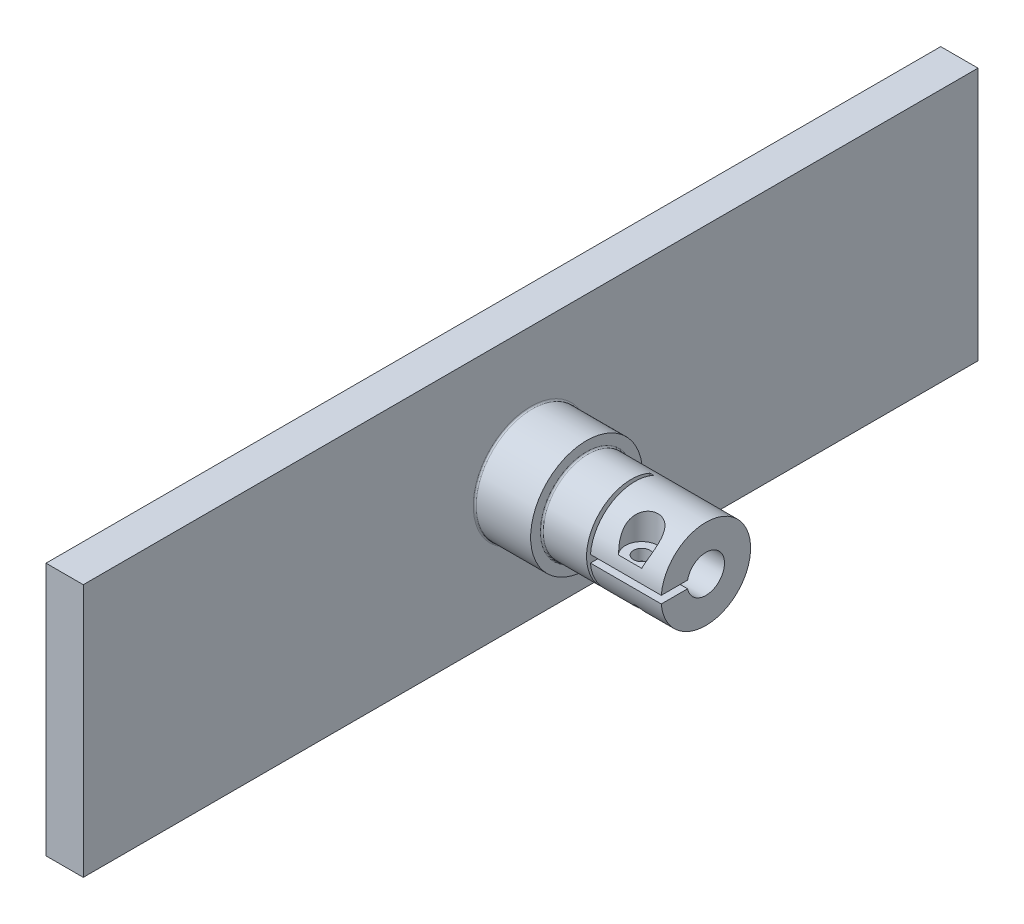
ISO-10303-21;
HEADER;
FILE_DESCRIPTION(('STEP AP214'),'2;1');
FILE_NAME('part.step','',(''),(''),'','','');
FILE_SCHEMA(('AUTOMOTIVE_DESIGN { 1 0 10303 214 1 1 1 1 }'));
ENDSEC;
DATA;
#1=APPLICATION_CONTEXT('core data for automotive mechanical design processes');
#2=APPLICATION_PROTOCOL_DEFINITION('international standard','automotive_design',2000,#1);
#3=PRODUCT_CONTEXT('',#1,'mechanical');
#4=PRODUCT('Part','Part','',(#3));
#5=PRODUCT_RELATED_PRODUCT_CATEGORY('part','',(#4));
#6=PRODUCT_DEFINITION_FORMATION('','',#4);
#7=PRODUCT_DEFINITION_CONTEXT('part definition',#1,'design');
#8=PRODUCT_DEFINITION('design','',#6,#7);
#9=PRODUCT_DEFINITION_SHAPE('','',#8);
#10=(LENGTH_UNIT() NAMED_UNIT(*) SI_UNIT(.MILLI.,.METRE.));
#11=(NAMED_UNIT(*) PLANE_ANGLE_UNIT() SI_UNIT($,.RADIAN.));
#12=(NAMED_UNIT(*) SI_UNIT($,.STERADIAN.) SOLID_ANGLE_UNIT());
#13=UNCERTAINTY_MEASURE_WITH_UNIT(LENGTH_MEASURE(1.E-05),#10,'distance_accuracy_value','');
#14=(GEOMETRIC_REPRESENTATION_CONTEXT(3) GLOBAL_UNCERTAINTY_ASSIGNED_CONTEXT((#13)) GLOBAL_UNIT_ASSIGNED_CONTEXT((#10,
#11,#12)) REPRESENTATION_CONTEXT('',''));
#15=CARTESIAN_POINT('',(0.,0.,0.));
#16=DIRECTION('',(0.,0.,1.));
#17=DIRECTION('',(1.,0.,0.));
#18=AXIS2_PLACEMENT_3D('',#15,#16,#17);
#19=CARTESIAN_POINT('',(19.,17.5,0.));
#20=DIRECTION('',(0.,1.,0.));
#21=DIRECTION('',(0.,0.,1.));
#22=AXIS2_PLACEMENT_3D('',#19,#20,#21);
#23=PLANE('',#22);
#24=DIRECTION('',(0.,0.,1.));
#25=VECTOR('',#24,1.);
#26=CARTESIAN_POINT('',(28.5,17.5,0.));
#27=LINE('',#26,#25);
#28=CARTESIAN_POINT('',(28.5,17.5,62.4494897427832));
#29=VERTEX_POINT('',#28);
#30=CARTESIAN_POINT('',(28.5,17.5,65.9791303715507));
#31=VERTEX_POINT('',#30);
#32=EDGE_CURVE('E218',#29,#31,#27,.T.);
#33=ORIENTED_EDGE('',*,*,#32,.T.);
#34=DIRECTION('',(1.,0.,0.));
#35=VECTOR('',#34,1.);
#36=CARTESIAN_POINT('',(19.,17.5,65.9791303715507));
#37=LINE('',#36,#35);
#38=CARTESIAN_POINT('',(19.,17.5,65.9791303715507));
#39=VERTEX_POINT('',#38);
#40=EDGE_CURVE('E231',#39,#31,#37,.T.);
#41=ORIENTED_EDGE('',*,*,#40,.F.);
#42=DIRECTION('',(0.,0.,1.));
#43=VECTOR('',#42,1.);
#44=CARTESIAN_POINT('',(19.,17.5,0.));
#45=LINE('',#44,#43);
#46=CARTESIAN_POINT('',(19.,17.5,62.4494897427832));
#47=VERTEX_POINT('',#46);
#48=EDGE_CURVE('E238',#47,#39,#45,.T.);
#49=ORIENTED_EDGE('',*,*,#48,.F.);
#50=DIRECTION('',(1.,0.,0.));
#51=VECTOR('',#50,1.);
#52=CARTESIAN_POINT('',(19.,17.5,62.4494897427832));
#53=LINE('',#52,#51);
#54=EDGE_CURVE('E234',#47,#29,#53,.T.);
#55=ORIENTED_EDGE('',*,*,#54,.T.);
#56=EDGE_LOOP('',(#33,#41,#49,#55));
#57=FACE_BOUND('',#56,.T.);
#58=CARTESIAN_POINT('',(24.,17.5,64.1));
#59=DIRECTION('',(0.,1.,0.));
#60=DIRECTION('',(0.,0.,1.));
#61=AXIS2_PLACEMENT_3D('',#58,#59,#60);
#62=CIRCLE('',#61,1.1);
#63=CARTESIAN_POINT('',(24.,17.5,65.2));
#64=VERTEX_POINT('',#63);
#65=EDGE_CURVE('E306',#64,#64,#62,.F.);
#66=ORIENTED_EDGE('',*,*,#65,.F.);
#67=EDGE_LOOP('',(#66));
#68=FACE_BOUND('',#67,.T.);
#69=ADVANCED_FACE('F39',(#57,#68),#23,.F.);
#70=CARTESIAN_POINT('',(28.5,17.,60.));
#71=DIRECTION('',(-1.,0.,0.));
#72=DIRECTION('',(0.,0.,1.));
#73=AXIS2_PLACEMENT_3D('',#70,#71,#72);
#74=CYLINDRICAL_SURFACE('',#73,6.);
#75=CARTESIAN_POINT('',(12.7,17.,60.));
#76=DIRECTION('',(1.,0.,0.));
#77=DIRECTION('',(0.,0.,-1.));
#78=AXIS2_PLACEMENT_3D('',#75,#76,#77);
#79=CIRCLE('',#78,6.);
#80=CARTESIAN_POINT('',(12.7,17.,54.));
#81=VERTEX_POINT('',#80);
#82=EDGE_CURVE('E47',#81,#81,#79,.T.);
#83=ORIENTED_EDGE('',*,*,#82,.T.);
#84=EDGE_LOOP('',(#83));
#85=FACE_BOUND('',#84,.T.);
#86=CARTESIAN_POINT('',(24.,13.5373420613638,64.9));
#87=CARTESIAN_POINT('',(24.0326910598529,13.5373358261282,64.8999960831288));
#88=CARTESIAN_POINT('',(24.0654413604297,13.5344596757837,64.8979670005085));
#89=CARTESIAN_POINT('',(24.1295824931057,13.5233728538796,64.8901028186996));
#90=CARTESIAN_POINT('',(24.1609686036178,13.5151450196477,64.8842554742345));
#91=CARTESIAN_POINT('',(24.2210279802254,13.4945231042613,64.8694751126386));
#92=CARTESIAN_POINT('',(24.2497314549821,13.4821851441088,64.8605836182522));
#93=CARTESIAN_POINT('',(24.3045790675066,13.4543676173585,64.840329386584));
#94=CARTESIAN_POINT('',(24.3307227886647,13.438887540625,64.828966247999));
#95=CARTESIAN_POINT('',(24.3967939777907,13.3947568004842,64.7961841262141));
#96=CARTESIAN_POINT('',(24.4345369496735,13.3641195411807,64.7730528189364));
#97=CARTESIAN_POINT('',(24.503812646507,13.2992031672132,64.7229024486574));
#98=CARTESIAN_POINT('',(24.5353252437258,13.264912782615,64.6958712579704));
#99=CARTESIAN_POINT('',(24.6075638571252,13.1760248874167,64.6240592509601));
#100=CARTESIAN_POINT('',(24.6446679248419,13.1200696438822,64.5773106045231));
#101=CARTESIAN_POINT('',(24.7072096740054,13.0064219896725,64.478508854471));
#102=CARTESIAN_POINT('',(24.7326354419118,12.9487278687276,64.4264503999385));
#103=CARTESIAN_POINT('',(24.7723779951645,12.8318717444481,64.3166303674465));
#104=CARTESIAN_POINT('',(24.7863862384601,12.7727108903284,64.2587550946613));
#105=CARTESIAN_POINT('',(24.8012548368551,12.6560891268234,64.1397287512114));
#106=CARTESIAN_POINT('',(24.8021318254665,12.5986261588591,64.0785819232693));
#107=CARTESIAN_POINT('',(24.7905510698033,12.4989655565948,63.9679971067146));
#108=CARTESIAN_POINT('',(24.7808985232147,12.4561267836209,63.9188445001562));
#109=CARTESIAN_POINT('',(24.7514904426036,12.3735135399139,63.8209554622128));
#110=CARTESIAN_POINT('',(24.7317472872578,12.3337353831931,63.7722185951223));
#111=CARTESIAN_POINT('',(24.6864275894139,12.2661766058078,63.6869028600174));
#112=CARTESIAN_POINT('',(24.6628729684121,12.2376070462082,63.6498777330092));
#113=CARTESIAN_POINT('',(24.6085110487716,12.183923366862,63.5787404191828));
#114=CARTESIAN_POINT('',(24.5777119553254,12.1588053884221,63.5446249959237));
#115=CARTESIAN_POINT('',(24.514521881195,12.1165757564669,63.4861520476407));
#116=CARTESIAN_POINT('',(24.4831942733209,12.098826244029,63.4611087560935));
#117=CARTESIAN_POINT('',(24.4158712208695,12.0668512899427,63.4153802924156));
#118=CARTESIAN_POINT('',(24.3798771240256,12.0526248342358,63.3946938664841));
#119=CARTESIAN_POINT('',(24.3037460872294,12.0281199069179,63.358703439267));
#120=CARTESIAN_POINT('',(24.2635861836974,12.0178649733938,63.3434315722957));
#121=CARTESIAN_POINT('',(24.1805026289966,12.0018427020072,63.319433062768));
#122=CARTESIAN_POINT('',(24.1375804538601,11.9960729886549,63.3107029556133));
#123=CARTESIAN_POINT('',(24.0551693666994,11.9896302722449,63.3009429485867));
#124=CARTESIAN_POINT('',(24.0158015140529,11.9884800006123,63.2991921309115));
#125=CARTESIAN_POINT('',(23.937317874437,11.9899965771594,63.3014948261893));
#126=CARTESIAN_POINT('',(23.8982020106346,11.9926622005566,63.3055464767323));
#127=CARTESIAN_POINT('',(23.8229733719979,12.0015270893209,63.3189348102506));
#128=CARTESIAN_POINT('',(23.7868031425671,12.0075786305373,63.3280504453591));
#129=CARTESIAN_POINT('',(23.7166977599896,12.0229094342441,63.3509338918796));
#130=CARTESIAN_POINT('',(23.6827628083457,12.0321889872566,63.3647021220237));
#131=CARTESIAN_POINT('',(23.6163669616372,12.054195404842,63.3969712027512));
#132=CARTESIAN_POINT('',(23.5840427773373,12.0670595610424,63.4156584158838));
#133=CARTESIAN_POINT('',(23.5231562800736,12.0956588211593,63.4565966996679));
#134=CARTESIAN_POINT('',(23.4945952227885,12.1113948792143,63.4788489544401));
#135=CARTESIAN_POINT('',(23.4383954972611,12.1473661638914,63.5288806718873));
#136=CARTESIAN_POINT('',(23.4112625654635,12.167913102395,63.5570024760445));
#137=CARTESIAN_POINT('',(23.3621632033993,12.211610599715,63.6156146062454));
#138=CARTESIAN_POINT('',(23.3402003340359,12.234762936883,63.6461065456137));
#139=CARTESIAN_POINT('',(23.2925411039535,12.2941775275479,63.7227018858328));
#140=CARTESIAN_POINT('',(23.269645566151,12.3316347373784,63.7696311085308));
#141=CARTESIAN_POINT('',(23.233757037872,12.4098616340749,63.8645100121978));
#142=CARTESIAN_POINT('',(23.2207829908232,12.4506374940029,63.9124614664944));
#143=CARTESIAN_POINT('',(23.2015447836342,12.545871133098,64.0208499501623));
#144=CARTESIAN_POINT('',(23.1980510379959,12.6010425774424,64.0811497456494));
#145=CARTESIAN_POINT('',(23.2039628583592,12.7134855426486,64.1991025624687));
#146=CARTESIAN_POINT('',(23.2133844200248,12.7707595820354,64.2567522101356));
#147=CARTESIAN_POINT('',(23.2442735665679,12.8866937432298,64.3689023303967));
#148=CARTESIAN_POINT('',(23.2659044222258,12.9453621044686,64.4233488355819));
#149=CARTESIAN_POINT('',(23.3210304500775,13.0616040926046,64.5271489547376));
#150=CARTESIAN_POINT('',(23.354510896208,13.1191789852547,64.5765087922933));
#151=CARTESIAN_POINT('',(23.4202819245678,13.2112786075036,64.6527236329753));
#152=CARTESIAN_POINT('',(23.4489481626604,13.2468646968726,64.6814413085947));
#153=CARTESIAN_POINT('',(23.51223590392,13.3152678792038,64.7354652022117));
#154=CARTESIAN_POINT('',(23.5468484891899,13.3480890105501,64.7607764290142));
#155=CARTESIAN_POINT('',(23.6113984239121,13.3998582949868,64.7999691161534));
#156=CARTESIAN_POINT('',(23.6396482268955,13.4200234370474,64.8150072942991));
#157=CARTESIAN_POINT('',(23.6996263575463,13.4568858541339,64.8421961712071));
#158=CARTESIAN_POINT('',(23.73134950442,13.4735881893954,64.8543510871112));
#159=CARTESIAN_POINT('',(23.7899939480314,13.4985821438833,64.8723969224606));
#160=CARTESIAN_POINT('',(23.8162125521176,13.5079312071525,64.8790921322415));
#161=CARTESIAN_POINT('',(23.870156437459,13.5230358845441,64.8898679103582));
#162=CARTESIAN_POINT('',(23.8978774931895,13.5288010604929,64.8939554367765));
#163=CARTESIAN_POINT('',(23.9382149957321,13.53409742303,64.8977058475826));
#164=CARTESIAN_POINT('',(23.950521456086,13.5353105141234,64.8985638755571));
#165=CARTESIAN_POINT('',(23.9752157577013,13.5369341221041,64.8997117698791));
#166=CARTESIAN_POINT('',(23.9876036197084,13.5373444257519,64.9000014852692));
#167=CARTESIAN_POINT('',(24.,13.5373420613638,64.9));
#168=B_SPLINE_CURVE_WITH_KNOTS('',3,(#86,#87,#88,#89,#90,#91,#92,#93,#94,#95,#96,#97,#98,#99,
#100,#101,#102,#103,#104,#105,#106,#107,#108,#109,#110,#111,#112,#113,#114,#115,#116,#117,#118,
#119,#120,#121,#122,#123,#124,#125,#126,#127,#128,#129,#130,#131,#132,#133,#134,#135,#136,#137,
#138,#139,#140,#141,#142,#143,#144,#145,#146,#147,#148,#149,#150,#151,#152,#153,#154,#155,#156,
#157,#158,#159,#160,#161,#162,#163,#164,#165,#166,#167),.UNSPECIFIED.,.T.,.F.,(4,2,2,2,2,2,2,2,
2,2,2,2,2,2,2,2,2,2,2,2,2,2,2,2,2,2,2,2,2,2,2,2,2,2,2,2,2,2,2,2,4),(0.,0.0980044215290841,
0.196324700009352,0.2933540393629,0.390399144451719,0.550992383424809,0.712096246020463,
0.956230462260393,1.20061318025828,1.45139938239139,1.70186788383303,1.89889600485294,
2.09568299927443,2.25217995180785,2.4085004999854,2.53953503013011,2.67053180001914,
2.80229348463062,2.93398533717623,3.05165505604012,3.16928701508618,3.28214737080922,
3.39501788663557,3.51300883852875,3.63103906241896,3.76298468546012,3.89502092245226,
4.08674784868779,4.27883993769078,4.5229779133623,4.76741852830734,5.01520815791879,
5.26269092236209,5.4242311870132,5.58553126717296,5.69869290782906,5.8116880001556,
5.89726447377946,5.98261163792294,6.01976483846105,6.05692790643729),.UNSPECIFIED.);
#169=CARTESIAN_POINT('',(24.,13.5373420613638,64.9));
#170=VERTEX_POINT('',#169);
#171=EDGE_CURVE('E135',#170,#170,#168,.T.);
#172=ORIENTED_EDGE('',*,*,#171,.T.);
#173=EDGE_LOOP('',(#172));
#174=FACE_BOUND('',#173,.T.);
#175=CARTESIAN_POINT('',(22.4455853687521,19.,65.6568542494924));
#176=CARTESIAN_POINT('',(22.4172460097947,19.0800006925904,65.6285651972429));
#177=CARTESIAN_POINT('',(22.3887909083147,19.1593571644015,65.5986037299058));
#178=CARTESIAN_POINT('',(22.3321521031906,19.3168253437857,65.5352990071714));
#179=CARTESIAN_POINT('',(22.3039684473754,19.3949368335243,65.5019551673158));
#180=CARTESIAN_POINT('',(22.2203692755019,19.6280552136032,65.396526599237));
#181=CARTESIAN_POINT('',(22.1661431437885,19.7811990378514,65.3192731313046));
#182=CARTESIAN_POINT('',(22.0638786657281,20.0843864323576,65.1494858177814));
#183=CARTESIAN_POINT('',(22.0159488701835,20.2343455422945,65.0567343217611));
#184=CARTESIAN_POINT('',(21.9314414188553,20.5273807495183,64.8568451441069));
#185=CARTESIAN_POINT('',(21.8948397008268,20.6704708830732,64.7497386579799));
#186=CARTESIAN_POINT('',(21.8380362790862,20.9458699351821,64.5234142050623));
#187=CARTESIAN_POINT('',(21.8175455244457,21.0783286671214,64.4044550130077));
#188=CARTESIAN_POINT('',(21.7971357554518,21.3324473597698,64.1546832756087));
#189=CARTESIAN_POINT('',(21.7971216710671,21.4541546023724,64.0239283280407));
#190=CARTESIAN_POINT('',(21.8211500192023,21.6660831894942,63.7749205044664));
#191=CARTESIAN_POINT('',(21.8413817751672,21.758238056923,63.6579685895926));
#192=CARTESIAN_POINT('',(21.903743540656,21.9311361502161,63.4212988545483));
#193=CARTESIAN_POINT('',(21.9458640211855,22.0118843224094,63.3015822596016));
#194=CARTESIAN_POINT('',(22.0460015109525,22.1486205132488,63.0831326998661));
#195=CARTESIAN_POINT('',(22.1005652442604,22.2065065440826,62.9840109163668));
#196=CARTESIAN_POINT('',(22.227457474178,22.3120364427293,62.7918226558323));
#197=CARTESIAN_POINT('',(22.2997788620368,22.3596843947764,62.6987537745086));
#198=CARTESIAN_POINT('',(22.4616025731061,22.4447471588194,62.5227650782706));
#199=CARTESIAN_POINT('',(22.5511643776819,22.4821254228163,62.4398820767954));
#200=CARTESIAN_POINT('',(22.7451150885592,22.546897997321,62.2888220159677));
#201=CARTESIAN_POINT('',(22.8495037111063,22.5742924988615,62.2206446752422));
#202=CARTESIAN_POINT('',(23.0627096580656,22.6184861451347,62.1062157028713));
#203=CARTESIAN_POINT('',(23.1708026722991,22.635856445182,62.0588302952898));
#204=CARTESIAN_POINT('',(23.3939989030437,22.6633984095729,61.9818181346854));
#205=CARTESIAN_POINT('',(23.5091012636545,22.6735709509168,61.952189218216));
#206=CARTESIAN_POINT('',(23.7413323006005,22.687197470238,61.9121271329164));
#207=CARTESIAN_POINT('',(23.8584110334964,22.6907423015815,61.9014344927658));
#208=CARTESIAN_POINT('',(24.092800654465,22.6916100109298,61.8988360041131));
#209=CARTESIAN_POINT('',(24.2101115402583,22.6889329497262,61.9069299720549));
#210=CARTESIAN_POINT('',(24.4417552993547,22.6771842811697,61.9416254821625));
#211=CARTESIAN_POINT('',(24.5560851215442,22.6681063699156,61.9682452692146));
#212=CARTESIAN_POINT('',(24.7783839725321,22.6430379302806,62.0389999994213));
#213=CARTESIAN_POINT('',(24.886353409861,22.627047846423,62.0831338162297));
#214=CARTESIAN_POINT('',(25.092777600508,22.5874552415341,62.1871027731155));
#215=CARTESIAN_POINT('',(25.1912424695034,22.5638609323721,62.246920962568));
#216=CARTESIAN_POINT('',(25.3761452783647,22.5083433788116,62.3797724242026));
#217=CARTESIAN_POINT('',(25.4625844075974,22.476420958977,62.4528043878733));
#218=CARTESIAN_POINT('',(25.622100870086,22.4034872599975,62.6095663295287));
#219=CARTESIAN_POINT('',(25.695069186784,22.3624073012088,62.6933750068598));
#220=CARTESIAN_POINT('',(25.8257278923422,22.2712457482171,62.8676880974195));
#221=CARTESIAN_POINT('',(25.8834161611717,22.2211629065254,62.9581934375506));
#222=CARTESIAN_POINT('',(25.9861759902884,22.1094245622019,63.1474593438883));
#223=CARTESIAN_POINT('',(26.0303822400023,22.0472850618702,63.2464004459285));
#224=CARTESIAN_POINT('',(26.102672623898,21.9143393918075,63.4443422821584));
#225=CARTESIAN_POINT('',(26.1307478452377,21.843528457028,63.5433430191174));
#226=CARTESIAN_POINT('',(26.1666631652576,21.7150274714282,63.7116646022225));
#227=CARTESIAN_POINT('',(26.1779483071328,21.6591036279762,63.7816418878274));
#228=CARTESIAN_POINT('',(26.1936776036614,21.5437675466288,63.91947245699));
#229=CARTESIAN_POINT('',(26.1981192743756,21.4843540502312,63.9873249605764));
#230=CARTESIAN_POINT('',(26.2023114866724,21.3013326838767,64.1870118621917));
#231=CARTESIAN_POINT('',(26.1929037166032,21.173046759621,64.3148406983649));
#232=CARTESIAN_POINT('',(26.1606715191726,20.9439487698666,64.5235282932769));
#233=CARTESIAN_POINT('',(26.1422650441784,20.8453222898624,64.6076154471031));
#234=CARTESIAN_POINT('',(26.0976370652075,20.6439098599582,64.7684925828821));
#235=CARTESIAN_POINT('',(26.0714115537968,20.5411218005564,64.8452787962561));
#236=CARTESIAN_POINT('',(25.9835154822768,20.2271822872403,65.06463600002));
#237=CARTESIAN_POINT('',(25.912664435968,20.0106784825766,65.1960042726809));
#238=CARTESIAN_POINT('',(25.7912398800787,19.6605487719524,65.3798282415838));
#239=CARTESIAN_POINT('',(25.7447140446572,19.530472316721,65.4422006750514));
#240=CARTESIAN_POINT('',(25.6501747865052,19.2675178594489,65.556858046427));
#241=CARTESIAN_POINT('',(25.602172268379,19.1346619986585,65.6092026462422));
#242=CARTESIAN_POINT('',(25.5544146312479,19.,65.6568542494924));
#243=B_SPLINE_CURVE_WITH_KNOTS('',3,(#175,#176,#177,#178,#179,#180,#181,#182,#183,#184,#185,
#186,#187,#188,#189,#190,#191,#192,#193,#194,#195,#196,#197,#198,#199,#200,#201,#202,#203,#204,
#205,#206,#207,#208,#209,#210,#211,#212,#213,#214,#215,#216,#217,#218,#219,#220,#221,#222,#223,
#224,#225,#226,#227,#228,#229,#230,#231,#232,#233,#234,#235,#236,#237,#238,#239,#240,#241,#242),
.UNSPECIFIED.,.F.,.F.,(4,2,2,2,2,2,2,2,2,2,2,2,2,2,2,2,2,2,2,2,2,2,2,2,2,2,2,2,2,2,2,2,2,4),(0.,
0.26834714246317,0.536740733300528,1.07569956745189,1.62298569977411,2.16910122082248,
2.70517973283582,3.23876930676615,3.68782769535273,4.13669075530958,4.51633127548198,
4.8958200648951,5.27664239150379,5.65745743094378,6.01361690535165,6.36973297655272,
6.72093052755799,7.07212464717252,7.42366512560912,7.7751829997597,8.12632253154853,
8.47742731029598,8.83125961976626,9.1851409960281,9.55842767834278,9.9319204140883,
10.2024230344321,10.4730238146002,11.0147336286093,11.4069807692624,11.7994292920988,
12.585224354639,13.0396654286373,13.4913125242298),.UNSPECIFIED.);
#244=CARTESIAN_POINT('',(22.4455853687521,19.,65.6568542494924));
#245=VERTEX_POINT('',#244);
#246=CARTESIAN_POINT('',(25.5544146312479,19.,65.6568542494924));
#247=VERTEX_POINT('',#246);
#248=EDGE_CURVE('E125',#245,#247,#243,.T.);
#249=ORIENTED_EDGE('',*,*,#248,.T.);
#250=DIRECTION('',(-1.,0.,0.));
#251=VECTOR('',#250,1.);
#252=CARTESIAN_POINT('',(28.5,19.,65.6568542494924));
#253=LINE('',#252,#251);
#254=EDGE_CURVE('E129',#247,#245,#253,.T.);
#255=ORIENTED_EDGE('',*,*,#254,.T.);
#256=EDGE_LOOP('',(#249,#255));
#257=FACE_BOUND('',#256,.T.);
#258=CARTESIAN_POINT('',(19.,17.,60.));
#259=DIRECTION('',(1.,0.,0.));
#260=DIRECTION('',(0.,0.,-1.));
#261=AXIS2_PLACEMENT_3D('',#258,#259,#260);
#262=CIRCLE('',#261,6.);
#263=CARTESIAN_POINT('',(19.,22.4543560573179,57.5));
#264=VERTEX_POINT('',#263);
#265=EDGE_CURVE('E224',#264,#39,#262,.T.);
#266=ORIENTED_EDGE('',*,*,#265,.T.);
#267=ORIENTED_EDGE('',*,*,#40,.T.);
#268=CARTESIAN_POINT('',(28.5,17.,60.));
#269=DIRECTION('',(1.,0.,0.));
#270=DIRECTION('',(0.,0.,-1.));
#271=AXIS2_PLACEMENT_3D('',#268,#269,#270);
#272=CIRCLE('',#271,6.);
#273=CARTESIAN_POINT('',(28.5,16.5,65.9791303715507));
#274=VERTEX_POINT('',#273);
#275=EDGE_CURVE('E230',#274,#31,#272,.T.);
#276=ORIENTED_EDGE('',*,*,#275,.F.);
#277=DIRECTION('',(1.,0.,0.));
#278=VECTOR('',#277,1.);
#279=CARTESIAN_POINT('',(19.,16.5,65.9791303715507));
#280=LINE('',#279,#278);
#281=CARTESIAN_POINT('',(19.,16.5,65.9791303715507));
#282=VERTEX_POINT('',#281);
#283=EDGE_CURVE('E228',#282,#274,#280,.T.);
#284=ORIENTED_EDGE('',*,*,#283,.F.);
#285=CARTESIAN_POINT('',(19.,11.5456439426821,57.5));
#286=VERTEX_POINT('',#285);
#287=EDGE_CURVE('E281',#282,#286,#262,.T.);
#288=ORIENTED_EDGE('',*,*,#287,.T.);
#289=DIRECTION('',(-1.,0.,0.));
#290=VECTOR('',#289,1.);
#291=CARTESIAN_POINT('',(28.5,11.5456439426821,57.5));
#292=LINE('',#291,#290);
#293=CARTESIAN_POINT('',(18.5,11.5456439426821,57.5));
#294=VERTEX_POINT('',#293);
#295=EDGE_CURVE('E276',#294,#286,#292,.F.);
#296=ORIENTED_EDGE('',*,*,#295,.F.);
#297=CARTESIAN_POINT('',(18.5,17.,60.));
#298=DIRECTION('',(-1.,0.,0.));
#299=DIRECTION('',(0.,0.,1.));
#300=AXIS2_PLACEMENT_3D('',#297,#298,#299);
#301=CIRCLE('',#300,6.);
#302=CARTESIAN_POINT('',(18.5,22.4543560573179,57.5));
#303=VERTEX_POINT('',#302);
#304=EDGE_CURVE('E130',#294,#303,#301,.T.);
#305=ORIENTED_EDGE('',*,*,#304,.T.);
#306=DIRECTION('',(-1.,0.,0.));
#307=VECTOR('',#306,1.);
#308=CARTESIAN_POINT('',(28.5,22.4543560573179,57.5));
#309=LINE('',#308,#307);
#310=EDGE_CURVE('E275',#264,#303,#309,.T.);
#311=ORIENTED_EDGE('',*,*,#310,.F.);
#312=EDGE_LOOP('',(#266,#267,#276,#284,#288,#296,#305,#311));
#313=FACE_BOUND('',#312,.T.);
#314=ADVANCED_FACE('F137',(#85,#174,#257,#313),#74,.T.);
#315=CARTESIAN_POINT('',(28.5,17.,60.));
#316=DIRECTION('',(1.,0.,0.));
#317=DIRECTION('',(0.,0.,-1.));
#318=AXIS2_PLACEMENT_3D('',#315,#316,#317);
#319=PLANE('',#318);
#320=CARTESIAN_POINT('',(28.5,17.,60.));
#321=DIRECTION('',(1.,0.,0.));
#322=DIRECTION('',(0.,0.,-1.));
#323=AXIS2_PLACEMENT_3D('',#320,#321,#322);
#324=CIRCLE('',#323,2.5);
#325=CARTESIAN_POINT('',(28.5,16.5,62.4494897427832));
#326=VERTEX_POINT('',#325);
#327=EDGE_CURVE('E214',#326,#29,#324,.T.);
#328=ORIENTED_EDGE('',*,*,#327,.F.);
#329=DIRECTION('',(0.,0.,1.));
#330=VECTOR('',#329,1.);
#331=CARTESIAN_POINT('',(28.5,16.5,0.));
#332=LINE('',#331,#330);
#333=EDGE_CURVE('E216',#326,#274,#332,.T.);
#334=ORIENTED_EDGE('',*,*,#333,.T.);
#335=ORIENTED_EDGE('',*,*,#275,.T.);
#336=ORIENTED_EDGE('',*,*,#32,.F.);
#337=EDGE_LOOP('',(#328,#334,#335,#336));
#338=FACE_BOUND('',#337,.T.);
#339=ADVANCED_FACE('F198',(#338),#319,.T.);
#340=CARTESIAN_POINT('',(5.,0.,120.));
#341=DIRECTION('',(0.,0.,1.));
#342=DIRECTION('',(1.,0.,0.));
#343=AXIS2_PLACEMENT_3D('',#340,#341,#342);
#344=PLANE('',#343);
#345=DIRECTION('',(0.,1.,0.));
#346=VECTOR('',#345,1.);
#347=CARTESIAN_POINT('',(0.,0.,120.));
#348=LINE('',#347,#346);
#349=CARTESIAN_POINT('',(0.,0.,120.));
#350=VERTEX_POINT('',#349);
#351=CARTESIAN_POINT('',(0.,34.,120.));
#352=VERTEX_POINT('',#351);
#353=EDGE_CURVE('E243',#350,#352,#348,.T.);
#354=ORIENTED_EDGE('',*,*,#353,.F.);
#355=DIRECTION('',(-1.,0.,0.));
#356=VECTOR('',#355,1.);
#357=CARTESIAN_POINT('',(5.,0.,120.));
#358=LINE('',#357,#356);
#359=CARTESIAN_POINT('',(5.,0.,120.));
#360=VERTEX_POINT('',#359);
#361=EDGE_CURVE('E271',#360,#350,#358,.T.);
#362=ORIENTED_EDGE('',*,*,#361,.F.);
#363=DIRECTION('',(0.,1.,0.));
#364=VECTOR('',#363,1.);
#365=CARTESIAN_POINT('',(5.,0.,120.));
#366=LINE('',#365,#364);
#367=CARTESIAN_POINT('',(5.,34.,120.));
#368=VERTEX_POINT('',#367);
#369=EDGE_CURVE('E244',#360,#368,#366,.T.);
#370=ORIENTED_EDGE('',*,*,#369,.T.);
#371=DIRECTION('',(-1.,0.,0.));
#372=VECTOR('',#371,1.);
#373=CARTESIAN_POINT('',(5.,34.,120.));
#374=LINE('',#373,#372);
#375=EDGE_CURVE('E255',#368,#352,#374,.T.);
#376=ORIENTED_EDGE('',*,*,#375,.T.);
#377=EDGE_LOOP('',(#354,#362,#370,#376));
#378=FACE_BOUND('',#377,.T.);
#379=ADVANCED_FACE('F200',(#378),#344,.T.);
#380=CARTESIAN_POINT('',(5.,0.,0.));
#381=DIRECTION('',(0.,-1.,0.));
#382=DIRECTION('',(0.,0.,-1.));
#383=AXIS2_PLACEMENT_3D('',#380,#381,#382);
#384=PLANE('',#383);
#385=DIRECTION('',(0.,0.,1.));
#386=VECTOR('',#385,1.);
#387=CARTESIAN_POINT('',(0.,0.,0.));
#388=LINE('',#387,#386);
#389=CARTESIAN_POINT('',(0.,0.,0.));
#390=VERTEX_POINT('',#389);
#391=EDGE_CURVE('E258',#390,#350,#388,.T.);
#392=ORIENTED_EDGE('',*,*,#391,.F.);
#393=DIRECTION('',(-1.,0.,0.));
#394=VECTOR('',#393,1.);
#395=CARTESIAN_POINT('',(5.,0.,0.));
#396=LINE('',#395,#394);
#397=CARTESIAN_POINT('',(5.,0.,0.));
#398=VERTEX_POINT('',#397);
#399=EDGE_CURVE('E269',#398,#390,#396,.T.);
#400=ORIENTED_EDGE('',*,*,#399,.F.);
#401=DIRECTION('',(0.,0.,1.));
#402=VECTOR('',#401,1.);
#403=CARTESIAN_POINT('',(5.,0.,0.));
#404=LINE('',#403,#402);
#405=EDGE_CURVE('E247',#398,#360,#404,.T.);
#406=ORIENTED_EDGE('',*,*,#405,.T.);
#407=ORIENTED_EDGE('',*,*,#361,.T.);
#408=EDGE_LOOP('',(#392,#400,#406,#407));
#409=FACE_BOUND('',#408,.T.);
#410=ADVANCED_FACE('F206',(#409),#384,.T.);
#411=CARTESIAN_POINT('',(5.,0.,0.));
#412=DIRECTION('',(0.,0.,1.));
#413=DIRECTION('',(0.,-1.,0.));
#414=AXIS2_PLACEMENT_3D('',#411,#412,#413);
#415=PLANE('',#414);
#416=DIRECTION('',(0.,1.,0.));
#417=VECTOR('',#416,1.);
#418=CARTESIAN_POINT('',(0.,0.,0.));
#419=LINE('',#418,#417);
#420=CARTESIAN_POINT('',(0.,34.,0.));
#421=VERTEX_POINT('',#420);
#422=EDGE_CURVE('E261',#390,#421,#419,.T.);
#423=ORIENTED_EDGE('',*,*,#422,.T.);
#424=DIRECTION('',(-1.,0.,0.));
#425=VECTOR('',#424,1.);
#426=CARTESIAN_POINT('',(5.,34.,0.));
#427=LINE('',#426,#425);
#428=CARTESIAN_POINT('',(5.,34.,0.));
#429=VERTEX_POINT('',#428);
#430=EDGE_CURVE('E266',#429,#421,#427,.T.);
#431=ORIENTED_EDGE('',*,*,#430,.F.);
#432=DIRECTION('',(0.,1.,0.));
#433=VECTOR('',#432,1.);
#434=CARTESIAN_POINT('',(5.,0.,0.));
#435=LINE('',#434,#433);
#436=EDGE_CURVE('E251',#398,#429,#435,.T.);
#437=ORIENTED_EDGE('',*,*,#436,.F.);
#438=ORIENTED_EDGE('',*,*,#399,.T.);
#439=EDGE_LOOP('',(#423,#431,#437,#438));
#440=FACE_BOUND('',#439,.T.);
#441=ADVANCED_FACE('F458',(#440),#415,.F.);
#442=CARTESIAN_POINT('',(5.,34.,0.));
#443=DIRECTION('',(0.,-1.,0.));
#444=DIRECTION('',(0.,0.,-1.));
#445=AXIS2_PLACEMENT_3D('',#442,#443,#444);
#446=PLANE('',#445);
#447=DIRECTION('',(0.,0.,1.));
#448=VECTOR('',#447,1.);
#449=CARTESIAN_POINT('',(0.,34.,0.));
#450=LINE('',#449,#448);
#451=EDGE_CURVE('E248',#421,#352,#450,.T.);
#452=ORIENTED_EDGE('',*,*,#451,.T.);
#453=ORIENTED_EDGE('',*,*,#375,.F.);
#454=DIRECTION('',(0.,0.,1.));
#455=VECTOR('',#454,1.);
#456=CARTESIAN_POINT('',(5.,34.,0.));
#457=LINE('',#456,#455);
#458=EDGE_CURVE('E253',#429,#368,#457,.T.);
#459=ORIENTED_EDGE('',*,*,#458,.F.);
#460=ORIENTED_EDGE('',*,*,#430,.T.);
#461=EDGE_LOOP('',(#452,#453,#459,#460));
#462=FACE_BOUND('',#461,.T.);
#463=ADVANCED_FACE('F437',(#462),#446,.F.);
#464=CARTESIAN_POINT('',(5.,0.,0.));
#465=DIRECTION('',(1.,0.,0.));
#466=DIRECTION('',(0.,0.,-1.));
#467=AXIS2_PLACEMENT_3D('',#464,#465,#466);
#468=PLANE('',#467);
#469=CARTESIAN_POINT('',(5.,17.,60.));
#470=DIRECTION('',(1.,0.,0.));
#471=DIRECTION('',(0.,0.,-1.));
#472=AXIS2_PLACEMENT_3D('',#469,#470,#471);
#473=CIRCLE('',#472,7.7);
#474=CARTESIAN_POINT('',(5.,17.,52.3));
#475=VERTEX_POINT('',#474);
#476=EDGE_CURVE('E142',#475,#475,#473,.F.);
#477=ORIENTED_EDGE('',*,*,#476,.T.);
#478=EDGE_LOOP('',(#477));
#479=FACE_BOUND('',#478,.T.);
#480=ORIENTED_EDGE('',*,*,#369,.F.);
#481=ORIENTED_EDGE('',*,*,#405,.F.);
#482=ORIENTED_EDGE('',*,*,#436,.T.);
#483=ORIENTED_EDGE('',*,*,#458,.T.);
#484=EDGE_LOOP('',(#480,#481,#482,#483));
#485=FACE_BOUND('',#484,.T.);
#486=ADVANCED_FACE('F433',(#479,#485),#468,.T.);
#487=CARTESIAN_POINT('',(0.,0.,0.));
#488=DIRECTION('',(1.,0.,0.));
#489=DIRECTION('',(0.,0.,-1.));
#490=AXIS2_PLACEMENT_3D('',#487,#488,#489);
#491=PLANE('',#490);
#492=ORIENTED_EDGE('',*,*,#353,.T.);
#493=ORIENTED_EDGE('',*,*,#451,.F.);
#494=ORIENTED_EDGE('',*,*,#422,.F.);
#495=ORIENTED_EDGE('',*,*,#391,.T.);
#496=EDGE_LOOP('',(#492,#493,#494,#495));
#497=FACE_BOUND('',#496,.T.);
#498=ADVANCED_FACE('F425',(#497),#491,.F.);
#499=CARTESIAN_POINT('',(12.5,17.,60.));
#500=DIRECTION('',(-1.,0.,0.));
#501=DIRECTION('',(0.,0.,1.));
#502=AXIS2_PLACEMENT_3D('',#499,#500,#501);
#503=CYLINDRICAL_SURFACE('',#502,7.5);
#504=CARTESIAN_POINT('',(5.2,17.,60.));
#505=DIRECTION('',(1.,0.,0.));
#506=DIRECTION('',(0.,0.,-1.));
#507=AXIS2_PLACEMENT_3D('',#504,#505,#506);
#508=CIRCLE('',#507,7.5);
#509=CARTESIAN_POINT('',(5.2,17.,52.5));
#510=VERTEX_POINT('',#509);
#511=EDGE_CURVE('E139',#510,#510,#508,.T.);
#512=ORIENTED_EDGE('',*,*,#511,.T.);
#513=EDGE_LOOP('',(#512));
#514=FACE_BOUND('',#513,.T.);
#515=CARTESIAN_POINT('',(12.5,17.,60.));
#516=DIRECTION('',(1.,0.,0.));
#517=DIRECTION('',(0.,0.,-1.));
#518=AXIS2_PLACEMENT_3D('',#515,#516,#517);
#519=CIRCLE('',#518,7.5);
#520=CARTESIAN_POINT('',(12.5,17.,52.5));
#521=VERTEX_POINT('',#520);
#522=EDGE_CURVE('E240',#521,#521,#519,.T.);
#523=ORIENTED_EDGE('',*,*,#522,.F.);
#524=EDGE_LOOP('',(#523));
#525=FACE_BOUND('',#524,.T.);
#526=ADVANCED_FACE('F415',(#514,#525),#503,.T.);
#527=CARTESIAN_POINT('',(12.5,0.,0.));
#528=DIRECTION('',(1.,0.,0.));
#529=DIRECTION('',(0.,0.,-1.));
#530=AXIS2_PLACEMENT_3D('',#527,#528,#529);
#531=PLANE('',#530);
#532=CARTESIAN_POINT('',(12.5,17.,60.));
#533=DIRECTION('',(1.,0.,0.));
#534=DIRECTION('',(0.,0.,-1.));
#535=AXIS2_PLACEMENT_3D('',#532,#533,#534);
#536=CIRCLE('',#535,6.2);
#537=CARTESIAN_POINT('',(12.5,17.,53.8));
#538=VERTEX_POINT('',#537);
#539=EDGE_CURVE('E11',#538,#538,#536,.F.);
#540=ORIENTED_EDGE('',*,*,#539,.T.);
#541=EDGE_LOOP('',(#540));
#542=FACE_BOUND('',#541,.T.);
#543=ORIENTED_EDGE('',*,*,#522,.T.);
#544=EDGE_LOOP('',(#543));
#545=FACE_BOUND('',#544,.T.);
#546=ADVANCED_FACE('F196',(#542,#545),#531,.T.);
#547=CARTESIAN_POINT('',(19.,16.5,0.));
#548=DIRECTION('',(0.,1.,0.));
#549=DIRECTION('',(0.,0.,1.));
#550=AXIS2_PLACEMENT_3D('',#547,#548,#549);
#551=PLANE('',#550);
#552=CARTESIAN_POINT('',(24.,16.5,64.1));
#553=DIRECTION('',(0.,1.,0.));
#554=DIRECTION('',(0.,0.,1.));
#555=AXIS2_PLACEMENT_3D('',#552,#553,#554);
#556=CIRCLE('',#555,0.799999999999999);
#557=CARTESIAN_POINT('',(24.,16.5,64.9));
#558=VERTEX_POINT('',#557);
#559=EDGE_CURVE('E155',#558,#558,#556,.T.);
#560=ORIENTED_EDGE('',*,*,#559,.F.);
#561=EDGE_LOOP('',(#560));
#562=FACE_BOUND('',#561,.T.);
#563=ORIENTED_EDGE('',*,*,#333,.F.);
#564=DIRECTION('',(1.,0.,0.));
#565=VECTOR('',#564,1.);
#566=CARTESIAN_POINT('',(19.,16.5,62.4494897427832));
#567=LINE('',#566,#565);
#568=CARTESIAN_POINT('',(19.,16.5,62.4494897427832));
#569=VERTEX_POINT('',#568);
#570=EDGE_CURVE('E236',#569,#326,#567,.T.);
#571=ORIENTED_EDGE('',*,*,#570,.F.);
#572=DIRECTION('',(0.,0.,1.));
#573=VECTOR('',#572,1.);
#574=CARTESIAN_POINT('',(19.,16.5,0.));
#575=LINE('',#574,#573);
#576=EDGE_CURVE('E222',#569,#282,#575,.T.);
#577=ORIENTED_EDGE('',*,*,#576,.T.);
#578=ORIENTED_EDGE('',*,*,#283,.T.);
#579=EDGE_LOOP('',(#563,#571,#577,#578));
#580=FACE_BOUND('',#579,.T.);
#581=ADVANCED_FACE('F193',(#562,#580),#551,.T.);
#582=CARTESIAN_POINT('',(19.,17.,60.));
#583=DIRECTION('',(1.,0.,0.));
#584=DIRECTION('',(0.,0.,-1.));
#585=AXIS2_PLACEMENT_3D('',#582,#583,#584);
#586=CYLINDRICAL_SURFACE('',#585,2.5);
#587=ORIENTED_EDGE('',*,*,#327,.T.);
#588=ORIENTED_EDGE('',*,*,#54,.F.);
#589=CARTESIAN_POINT('',(19.,17.,60.));
#590=DIRECTION('',(1.,0.,0.));
#591=DIRECTION('',(0.,0.,-1.));
#592=AXIS2_PLACEMENT_3D('',#589,#590,#591);
#593=CIRCLE('',#592,2.5);
#594=CARTESIAN_POINT('',(19.,17.,57.5));
#595=VERTEX_POINT('',#594);
#596=EDGE_CURVE('E291',#595,#47,#593,.T.);
#597=ORIENTED_EDGE('',*,*,#596,.F.);
#598=EDGE_CURVE('E292',#569,#595,#593,.T.);
#599=ORIENTED_EDGE('',*,*,#598,.F.);
#600=ORIENTED_EDGE('',*,*,#570,.T.);
#601=EDGE_LOOP('',(#587,#588,#597,#599,#600));
#602=FACE_BOUND('',#601,.T.);
#603=ADVANCED_FACE('F183',(#602),#586,.F.);
#604=CARTESIAN_POINT('',(18.5,11.,57.5));
#605=DIRECTION('',(-1.,0.,0.));
#606=DIRECTION('',(0.,0.,1.));
#607=AXIS2_PLACEMENT_3D('',#604,#605,#606);
#608=PLANE('',#607);
#609=DIRECTION('',(0.,-1.,0.));
#610=VECTOR('',#609,1.);
#611=CARTESIAN_POINT('',(18.5,11.,57.5));
#612=LINE('',#611,#610);
#613=EDGE_CURVE('E279',#303,#294,#612,.T.);
#614=ORIENTED_EDGE('',*,*,#613,.F.);
#615=ORIENTED_EDGE('',*,*,#304,.F.);
#616=EDGE_LOOP('',(#614,#615));
#617=FACE_BOUND('',#616,.T.);
#618=ADVANCED_FACE('F179',(#617),#608,.F.);
#619=CARTESIAN_POINT('',(19.,11.,57.5));
#620=DIRECTION('',(1.,0.,0.));
#621=DIRECTION('',(0.,0.,-1.));
#622=AXIS2_PLACEMENT_3D('',#619,#620,#621);
#623=PLANE('',#622);
#624=ORIENTED_EDGE('',*,*,#287,.F.);
#625=ORIENTED_EDGE('',*,*,#576,.F.);
#626=ORIENTED_EDGE('',*,*,#598,.T.);
#627=DIRECTION('',(0.,1.,0.));
#628=VECTOR('',#627,1.);
#629=CARTESIAN_POINT('',(19.,11.,57.5));
#630=LINE('',#629,#628);
#631=EDGE_CURVE('E61',#286,#595,#630,.T.);
#632=ORIENTED_EDGE('',*,*,#631,.F.);
#633=EDGE_LOOP('',(#624,#625,#626,#632));
#634=FACE_BOUND('',#633,.T.);
#635=ADVANCED_FACE('F182',(#634),#623,.F.);
#636=EDGE_CURVE('E280',#595,#264,#630,.T.);
#637=ORIENTED_EDGE('',*,*,#636,.F.);
#638=ORIENTED_EDGE('',*,*,#596,.T.);
#639=ORIENTED_EDGE('',*,*,#48,.T.);
#640=ORIENTED_EDGE('',*,*,#265,.F.);
#641=EDGE_LOOP('',(#637,#638,#639,#640));
#642=FACE_BOUND('',#641,.T.);
#643=ADVANCED_FACE('F178',(#642),#623,.F.);
#644=CARTESIAN_POINT('',(0.,0.,57.5));
#645=DIRECTION('',(0.,0.,1.));
#646=DIRECTION('',(1.,0.,0.));
#647=AXIS2_PLACEMENT_3D('',#644,#645,#646);
#648=PLANE('',#647);
#649=ORIENTED_EDGE('',*,*,#310,.T.);
#650=ORIENTED_EDGE('',*,*,#613,.T.);
#651=ORIENTED_EDGE('',*,*,#295,.T.);
#652=ORIENTED_EDGE('',*,*,#631,.T.);
#653=ORIENTED_EDGE('',*,*,#636,.T.);
#654=EDGE_LOOP('',(#649,#650,#651,#652,#653));
#655=FACE_BOUND('',#654,.T.);
#656=ADVANCED_FACE('F171',(#655),#648,.T.);
#657=CARTESIAN_POINT('',(25.1,19.,64.1));
#658=DIRECTION('',(0.,-1.,0.));
#659=DIRECTION('',(0.,0.,-1.));
#660=AXIS2_PLACEMENT_3D('',#657,#658,#659);
#661=PLANE('',#660);
#662=CARTESIAN_POINT('',(24.,19.,64.1));
#663=DIRECTION('',(0.,1.,0.));
#664=DIRECTION('',(0.,0.,1.));
#665=AXIS2_PLACEMENT_3D('',#662,#663,#664);
#666=CIRCLE('',#665,1.1);
#667=CARTESIAN_POINT('',(24.,19.,65.2));
#668=VERTEX_POINT('',#667);
#669=EDGE_CURVE('E134',#668,#668,#666,.T.);
#670=ORIENTED_EDGE('',*,*,#669,.F.);
#671=EDGE_LOOP('',(#670));
#672=FACE_BOUND('',#671,.T.);
#673=CARTESIAN_POINT('',(24.,19.,64.1));
#674=DIRECTION('',(0.,1.,0.));
#675=DIRECTION('',(0.,0.,1.));
#676=AXIS2_PLACEMENT_3D('',#673,#674,#675);
#677=CIRCLE('',#676,2.2);
#678=EDGE_CURVE('E53',#247,#245,#677,.T.);
#679=ORIENTED_EDGE('',*,*,#678,.T.);
#680=ORIENTED_EDGE('',*,*,#254,.F.);
#681=EDGE_LOOP('',(#679,#680));
#682=FACE_BOUND('',#681,.T.);
#683=ADVANCED_FACE('F133',(#672,#682),#661,.F.);
#684=CARTESIAN_POINT('',(24.,23.,64.1));
#685=DIRECTION('',(0.,1.,0.));
#686=DIRECTION('',(0.,0.,1.));
#687=AXIS2_PLACEMENT_3D('',#684,#685,#686);
#688=CYLINDRICAL_SURFACE('',#687,2.2);
#689=ORIENTED_EDGE('',*,*,#678,.F.);
#690=ORIENTED_EDGE('',*,*,#248,.F.);
#691=EDGE_LOOP('',(#689,#690));
#692=FACE_BOUND('',#691,.T.);
#693=ADVANCED_FACE('F126',(#692),#688,.F.);
#694=CARTESIAN_POINT('',(24.,23.,64.1));
#695=DIRECTION('',(0.,1.,0.));
#696=DIRECTION('',(0.,0.,1.));
#697=AXIS2_PLACEMENT_3D('',#694,#695,#696);
#698=CYLINDRICAL_SURFACE('',#697,1.1);
#699=ORIENTED_EDGE('',*,*,#65,.T.);
#700=EDGE_LOOP('',(#699));
#701=FACE_BOUND('',#700,.T.);
#702=ORIENTED_EDGE('',*,*,#669,.T.);
#703=EDGE_LOOP('',(#702));
#704=FACE_BOUND('',#703,.T.);
#705=ADVANCED_FACE('F164',(#701,#704),#698,.F.);
#706=CARTESIAN_POINT('',(24.,16.5,64.1));
#707=DIRECTION('',(0.,1.,0.));
#708=DIRECTION('',(0.,0.,1.));
#709=AXIS2_PLACEMENT_3D('',#706,#707,#708);
#710=CYLINDRICAL_SURFACE('',#709,0.799999999999997);
#711=ORIENTED_EDGE('',*,*,#559,.T.);
#712=EDGE_LOOP('',(#711));
#713=FACE_BOUND('',#712,.T.);
#714=ORIENTED_EDGE('',*,*,#171,.F.);
#715=EDGE_LOOP('',(#714));
#716=FACE_BOUND('',#715,.T.);
#717=ADVANCED_FACE('F160',(#713,#716),#710,.F.);
#718=CARTESIAN_POINT('',(5.2,17.,60.));
#719=DIRECTION('',(1.,0.,0.));
#720=DIRECTION('',(0.,0.,-1.));
#721=AXIS2_PLACEMENT_3D('',#718,#719,#720);
#722=TOROIDAL_SURFACE('',#721,7.7,0.2);
#723=ORIENTED_EDGE('',*,*,#476,.F.);
#724=EDGE_LOOP('',(#723));
#725=FACE_BOUND('',#724,.T.);
#726=ORIENTED_EDGE('',*,*,#511,.F.);
#727=EDGE_LOOP('',(#726));
#728=FACE_BOUND('',#727,.T.);
#729=ADVANCED_FACE('F163',(#725,#728),#722,.F.);
#730=CARTESIAN_POINT('',(12.7,17.,60.));
#731=DIRECTION('',(1.,0.,0.));
#732=DIRECTION('',(0.,0.,-1.));
#733=AXIS2_PLACEMENT_3D('',#730,#731,#732);
#734=TOROIDAL_SURFACE('',#733,6.2,0.2);
#735=ORIENTED_EDGE('',*,*,#539,.F.);
#736=EDGE_LOOP('',(#735));
#737=FACE_BOUND('',#736,.T.);
#738=ORIENTED_EDGE('',*,*,#82,.F.);
#739=EDGE_LOOP('',(#738));
#740=FACE_BOUND('',#739,.T.);
#741=ADVANCED_FACE('F41',(#737,#740),#734,.F.);
#742=CLOSED_SHELL('',(#69,#314,#339,#379,#410,#441,#463,#486,#498,#526,#546,#581,#603,#618,#635,
#643,#656,#683,#693,#705,#717,#729,#741));
#743=MANIFOLD_SOLID_BREP('B2',#742);
#744=ADVANCED_BREP_SHAPE_REPRESENTATION('',(#18,#743),#14);
#745=SHAPE_DEFINITION_REPRESENTATION(#9,#744);
ENDSEC;
END-ISO-10303-21;
